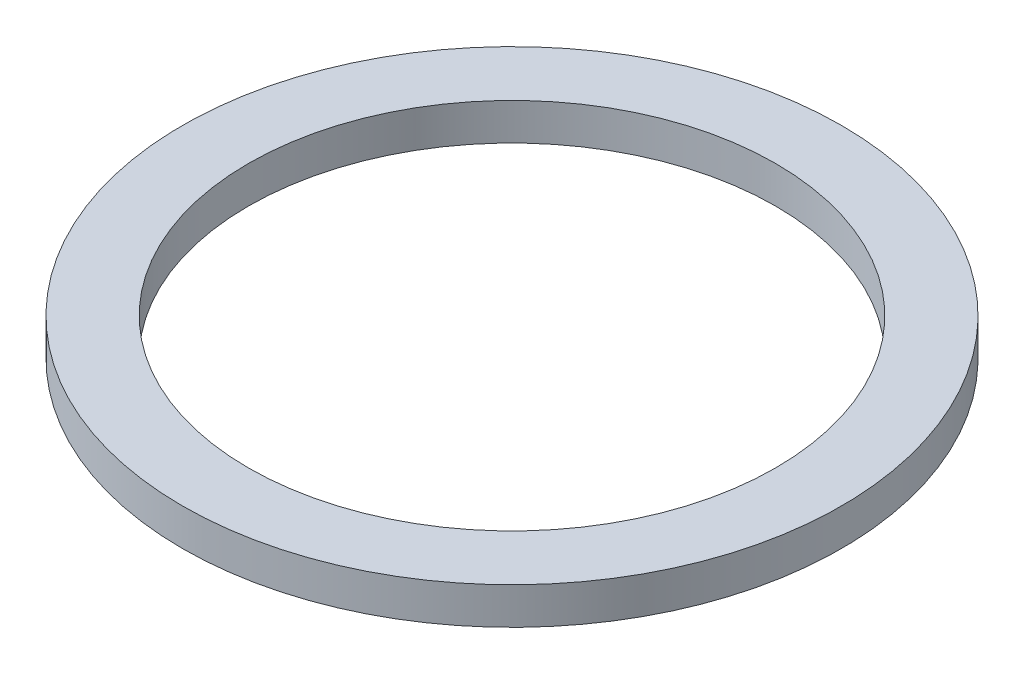
ISO-10303-21;
HEADER;
FILE_DESCRIPTION(('STEP AP214'),'2;1');
FILE_NAME('part.step','',(''),(''),'','','');
FILE_SCHEMA(('AUTOMOTIVE_DESIGN { 1 0 10303 214 1 1 1 1 }'));
ENDSEC;
DATA;
#1=APPLICATION_CONTEXT('core data for automotive mechanical design processes');
#2=APPLICATION_PROTOCOL_DEFINITION('international standard','automotive_design',2000,#1);
#3=PRODUCT_CONTEXT('',#1,'mechanical');
#4=PRODUCT('Part','Part','',(#3));
#5=PRODUCT_RELATED_PRODUCT_CATEGORY('part','',(#4));
#6=PRODUCT_DEFINITION_FORMATION('','',#4);
#7=PRODUCT_DEFINITION_CONTEXT('part definition',#1,'design');
#8=PRODUCT_DEFINITION('design','',#6,#7);
#9=PRODUCT_DEFINITION_SHAPE('','',#8);
#10=(LENGTH_UNIT() NAMED_UNIT(*) SI_UNIT(.MILLI.,.METRE.));
#11=(NAMED_UNIT(*) PLANE_ANGLE_UNIT() SI_UNIT($,.RADIAN.));
#12=(NAMED_UNIT(*) SI_UNIT($,.STERADIAN.) SOLID_ANGLE_UNIT());
#13=UNCERTAINTY_MEASURE_WITH_UNIT(LENGTH_MEASURE(1.E-05),#10,'distance_accuracy_value','');
#14=(GEOMETRIC_REPRESENTATION_CONTEXT(3) GLOBAL_UNCERTAINTY_ASSIGNED_CONTEXT((#13)) GLOBAL_UNIT_ASSIGNED_CONTEXT((#10,
#11,#12)) REPRESENTATION_CONTEXT('',''));
#15=CARTESIAN_POINT('',(0.,0.,0.));
#16=DIRECTION('',(0.,0.,1.));
#17=DIRECTION('',(1.,0.,0.));
#18=AXIS2_PLACEMENT_3D('',#15,#16,#17);
#19=CARTESIAN_POINT('',(0.,7.,0.));
#20=DIRECTION('',(0.,-1.,0.));
#21=DIRECTION('',(0.,0.,-1.));
#22=AXIS2_PLACEMENT_3D('',#19,#20,#21);
#23=CYLINDRICAL_SURFACE('',#22,62.5);
#24=CARTESIAN_POINT('',(0.,7.,0.));
#25=DIRECTION('',(0.,1.,0.));
#26=DIRECTION('',(0.,0.,1.));
#27=AXIS2_PLACEMENT_3D('',#24,#25,#26);
#28=CIRCLE('',#27,62.5);
#29=CARTESIAN_POINT('',(0.,7.,62.5));
#30=VERTEX_POINT('',#29);
#31=EDGE_CURVE('E10',#30,#30,#28,.T.);
#32=ORIENTED_EDGE('',*,*,#31,.F.);
#33=EDGE_LOOP('',(#32));
#34=FACE_BOUND('',#33,.T.);
#35=CARTESIAN_POINT('',(0.,0.,0.));
#36=DIRECTION('',(0.,1.,0.));
#37=DIRECTION('',(0.,0.,1.));
#38=AXIS2_PLACEMENT_3D('',#35,#36,#37);
#39=CIRCLE('',#38,62.5);
#40=CARTESIAN_POINT('',(0.,0.,62.5));
#41=VERTEX_POINT('',#40);
#42=EDGE_CURVE('E37',#41,#41,#39,.T.);
#43=ORIENTED_EDGE('',*,*,#42,.T.);
#44=EDGE_LOOP('',(#43));
#45=FACE_BOUND('',#44,.T.);
#46=ADVANCED_FACE('F40',(#34,#45),#23,.T.);
#47=CARTESIAN_POINT('',(0.,7.,0.));
#48=DIRECTION('',(0.,1.,0.));
#49=DIRECTION('',(0.,0.,1.));
#50=AXIS2_PLACEMENT_3D('',#47,#48,#49);
#51=PLANE('',#50);
#52=CARTESIAN_POINT('',(0.,7.,0.));
#53=DIRECTION('',(0.,1.,0.));
#54=DIRECTION('',(0.,0.,1.));
#55=AXIS2_PLACEMENT_3D('',#52,#53,#54);
#56=CIRCLE('',#55,50.);
#57=CARTESIAN_POINT('',(0.,7.,50.));
#58=VERTEX_POINT('',#57);
#59=EDGE_CURVE('E50',#58,#58,#56,.T.);
#60=ORIENTED_EDGE('',*,*,#59,.F.);
#61=EDGE_LOOP('',(#60));
#62=FACE_BOUND('',#61,.T.);
#63=ORIENTED_EDGE('',*,*,#31,.T.);
#64=EDGE_LOOP('',(#63));
#65=FACE_BOUND('',#64,.T.);
#66=ADVANCED_FACE('F59',(#62,#65),#51,.T.);
#67=CARTESIAN_POINT('',(0.,0.,0.));
#68=DIRECTION('',(0.,1.,0.));
#69=DIRECTION('',(0.,0.,1.));
#70=AXIS2_PLACEMENT_3D('',#67,#68,#69);
#71=PLANE('',#70);
#72=CARTESIAN_POINT('',(0.,0.,0.));
#73=DIRECTION('',(0.,1.,0.));
#74=DIRECTION('',(0.,0.,1.));
#75=AXIS2_PLACEMENT_3D('',#72,#73,#74);
#76=CIRCLE('',#75,50.);
#77=CARTESIAN_POINT('',(0.,0.,50.));
#78=VERTEX_POINT('',#77);
#79=EDGE_CURVE('E47',#78,#78,#76,.T.);
#80=ORIENTED_EDGE('',*,*,#79,.T.);
#81=EDGE_LOOP('',(#80));
#82=FACE_BOUND('',#81,.T.);
#83=ORIENTED_EDGE('',*,*,#42,.F.);
#84=EDGE_LOOP('',(#83));
#85=FACE_BOUND('',#84,.T.);
#86=ADVANCED_FACE('F58',(#82,#85),#71,.F.);
#87=CARTESIAN_POINT('',(0.,7.,0.));
#88=DIRECTION('',(0.,-1.,0.));
#89=DIRECTION('',(0.,0.,-1.));
#90=AXIS2_PLACEMENT_3D('',#87,#88,#89);
#91=CYLINDRICAL_SURFACE('',#90,50.);
#92=ORIENTED_EDGE('',*,*,#59,.T.);
#93=EDGE_LOOP('',(#92));
#94=FACE_BOUND('',#93,.T.);
#95=ORIENTED_EDGE('',*,*,#79,.F.);
#96=EDGE_LOOP('',(#95));
#97=FACE_BOUND('',#96,.T.);
#98=ADVANCED_FACE('F54',(#94,#97),#91,.F.);
#99=CLOSED_SHELL('',(#46,#66,#86,#98));
#100=MANIFOLD_SOLID_BREP('B2',#99);
#101=ADVANCED_BREP_SHAPE_REPRESENTATION('',(#18,#100),#14);
#102=SHAPE_DEFINITION_REPRESENTATION(#9,#101);
ENDSEC;
END-ISO-10303-21;
